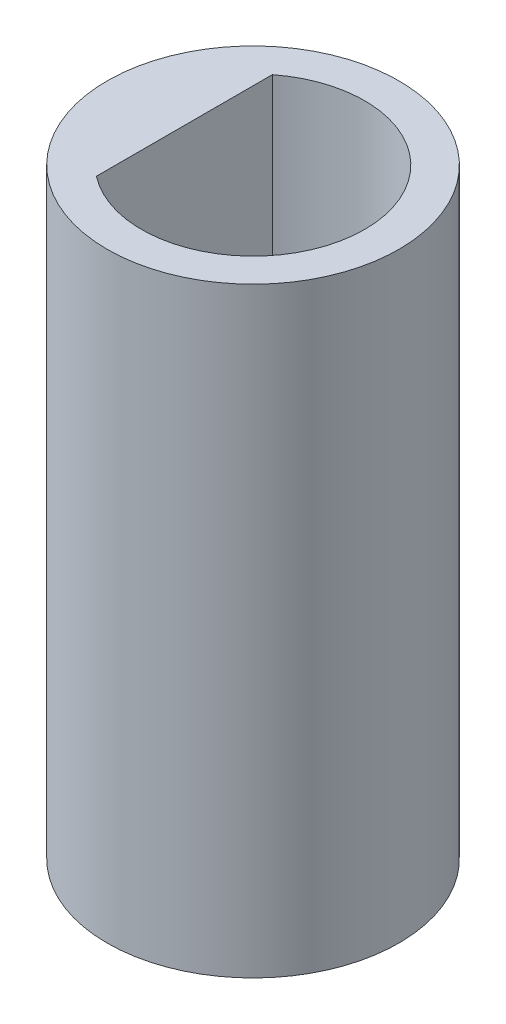
ISO-10303-21;
HEADER;
FILE_DESCRIPTION(('STEP AP214'),'2;1');
FILE_NAME('part.step','',(''),(''),'','','');
FILE_SCHEMA(('AUTOMOTIVE_DESIGN { 1 0 10303 214 1 1 1 1 }'));
ENDSEC;
DATA;
#1=APPLICATION_CONTEXT('core data for automotive mechanical design processes');
#2=APPLICATION_PROTOCOL_DEFINITION('international standard','automotive_design',2000,#1);
#3=PRODUCT_CONTEXT('',#1,'mechanical');
#4=PRODUCT('Part','Part','',(#3));
#5=PRODUCT_RELATED_PRODUCT_CATEGORY('part','',(#4));
#6=PRODUCT_DEFINITION_FORMATION('','',#4);
#7=PRODUCT_DEFINITION_CONTEXT('part definition',#1,'design');
#8=PRODUCT_DEFINITION('design','',#6,#7);
#9=PRODUCT_DEFINITION_SHAPE('','',#8);
#10=(LENGTH_UNIT() NAMED_UNIT(*) SI_UNIT(.MILLI.,.METRE.));
#11=(NAMED_UNIT(*) PLANE_ANGLE_UNIT() SI_UNIT($,.RADIAN.));
#12=(NAMED_UNIT(*) SI_UNIT($,.STERADIAN.) SOLID_ANGLE_UNIT());
#13=UNCERTAINTY_MEASURE_WITH_UNIT(LENGTH_MEASURE(1.E-05),#10,'distance_accuracy_value','');
#14=(GEOMETRIC_REPRESENTATION_CONTEXT(3) GLOBAL_UNCERTAINTY_ASSIGNED_CONTEXT((#13)) GLOBAL_UNIT_ASSIGNED_CONTEXT((#10,
#11,#12)) REPRESENTATION_CONTEXT('',''));
#15=CARTESIAN_POINT('',(0.,0.,0.));
#16=DIRECTION('',(0.,0.,1.));
#17=DIRECTION('',(1.,0.,0.));
#18=AXIS2_PLACEMENT_3D('',#15,#16,#17);
#19=CARTESIAN_POINT('',(0.,14.,0.));
#20=DIRECTION('',(0.,-1.,0.));
#21=DIRECTION('',(0.,0.,-1.));
#22=AXIS2_PLACEMENT_3D('',#19,#20,#21);
#23=CYLINDRICAL_SURFACE('',#22,3.4);
#24=CARTESIAN_POINT('',(0.,14.,0.));
#25=DIRECTION('',(0.,1.,0.));
#26=DIRECTION('',(0.,0.,1.));
#27=AXIS2_PLACEMENT_3D('',#24,#25,#26);
#28=CIRCLE('',#27,3.4);
#29=CARTESIAN_POINT('',(0.,14.,3.4));
#30=VERTEX_POINT('',#29);
#31=EDGE_CURVE('E11',#30,#30,#28,.T.);
#32=ORIENTED_EDGE('',*,*,#31,.F.);
#33=EDGE_LOOP('',(#32));
#34=FACE_BOUND('',#33,.T.);
#35=CARTESIAN_POINT('',(0.,0.,0.));
#36=DIRECTION('',(0.,1.,0.));
#37=DIRECTION('',(0.,0.,1.));
#38=AXIS2_PLACEMENT_3D('',#35,#36,#37);
#39=CIRCLE('',#38,3.4);
#40=CARTESIAN_POINT('',(0.,0.,3.4));
#41=VERTEX_POINT('',#40);
#42=EDGE_CURVE('E36',#41,#41,#39,.T.);
#43=ORIENTED_EDGE('',*,*,#42,.T.);
#44=EDGE_LOOP('',(#43));
#45=FACE_BOUND('',#44,.T.);
#46=ADVANCED_FACE('F33',(#34,#45),#23,.T.);
#47=CARTESIAN_POINT('',(0.,14.,0.));
#48=DIRECTION('',(0.,1.,0.));
#49=DIRECTION('',(0.,0.,1.));
#50=AXIS2_PLACEMENT_3D('',#47,#48,#49);
#51=PLANE('',#50);
#52=CARTESIAN_POINT('',(0.,14.,0.));
#53=DIRECTION('',(0.,1.,0.));
#54=DIRECTION('',(0.,0.,1.));
#55=AXIS2_PLACEMENT_3D('',#52,#53,#54);
#56=CIRCLE('',#55,2.6);
#57=CARTESIAN_POINT('',(-1.6,14.,2.04939015319192));
#58=VERTEX_POINT('',#57);
#59=CARTESIAN_POINT('',(-1.6,14.,-2.04939015319192));
#60=VERTEX_POINT('',#59);
#61=EDGE_CURVE('E47',#58,#60,#56,.T.);
#62=ORIENTED_EDGE('',*,*,#61,.F.);
#63=DIRECTION('',(0.,0.,1.));
#64=VECTOR('',#63,1.);
#65=CARTESIAN_POINT('',(-1.6,14.,-2.04939015319192));
#66=LINE('',#65,#64);
#67=EDGE_CURVE('E66',#60,#58,#66,.T.);
#68=ORIENTED_EDGE('',*,*,#67,.F.);
#69=EDGE_LOOP('',(#62,#68));
#70=FACE_BOUND('',#69,.T.);
#71=ORIENTED_EDGE('',*,*,#31,.T.);
#72=EDGE_LOOP('',(#71));
#73=FACE_BOUND('',#72,.T.);
#74=ADVANCED_FACE('F70',(#70,#73),#51,.T.);
#75=CARTESIAN_POINT('',(0.,0.,0.));
#76=DIRECTION('',(0.,1.,0.));
#77=DIRECTION('',(0.,0.,1.));
#78=AXIS2_PLACEMENT_3D('',#75,#76,#77);
#79=PLANE('',#78);
#80=DIRECTION('',(0.,0.,1.));
#81=VECTOR('',#80,1.);
#82=CARTESIAN_POINT('',(-1.6,0.,-2.04939015319192));
#83=LINE('',#82,#81);
#84=CARTESIAN_POINT('',(-1.6,0.,-2.04939015319192));
#85=VERTEX_POINT('',#84);
#86=CARTESIAN_POINT('',(-1.6,0.,2.04939015319192));
#87=VERTEX_POINT('',#86);
#88=EDGE_CURVE('E74',#85,#87,#83,.T.);
#89=ORIENTED_EDGE('',*,*,#88,.T.);
#90=CARTESIAN_POINT('',(0.,0.,0.));
#91=DIRECTION('',(0.,1.,0.));
#92=DIRECTION('',(0.,0.,1.));
#93=AXIS2_PLACEMENT_3D('',#90,#91,#92);
#94=CIRCLE('',#93,2.6);
#95=EDGE_CURVE('E52',#87,#85,#94,.T.);
#96=ORIENTED_EDGE('',*,*,#95,.T.);
#97=EDGE_LOOP('',(#89,#96));
#98=FACE_BOUND('',#97,.T.);
#99=ORIENTED_EDGE('',*,*,#42,.F.);
#100=EDGE_LOOP('',(#99));
#101=FACE_BOUND('',#100,.T.);
#102=ADVANCED_FACE('F78',(#98,#101),#79,.F.);
#103=CARTESIAN_POINT('',(0.,0.,0.));
#104=DIRECTION('',(0.,1.,0.));
#105=DIRECTION('',(0.,0.,1.));
#106=AXIS2_PLACEMENT_3D('',#103,#104,#105);
#107=CYLINDRICAL_SURFACE('',#106,2.6);
#108=ORIENTED_EDGE('',*,*,#61,.T.);
#109=DIRECTION('',(0.,1.,0.));
#110=VECTOR('',#109,1.);
#111=CARTESIAN_POINT('',(-1.6,0.,-2.04939015319192));
#112=LINE('',#111,#110);
#113=EDGE_CURVE('E63',#85,#60,#112,.T.);
#114=ORIENTED_EDGE('',*,*,#113,.F.);
#115=ORIENTED_EDGE('',*,*,#95,.F.);
#116=DIRECTION('',(0.,1.,0.));
#117=VECTOR('',#116,1.);
#118=CARTESIAN_POINT('',(-1.6,0.,2.04939015319192));
#119=LINE('',#118,#117);
#120=EDGE_CURVE('E57',#87,#58,#119,.T.);
#121=ORIENTED_EDGE('',*,*,#120,.T.);
#122=EDGE_LOOP('',(#108,#114,#115,#121));
#123=FACE_BOUND('',#122,.T.);
#124=ADVANCED_FACE('F59',(#123),#107,.F.);
#125=CARTESIAN_POINT('',(-1.6,0.,-2.04939015319192));
#126=DIRECTION('',(-1.,0.,0.));
#127=DIRECTION('',(0.,0.,1.));
#128=AXIS2_PLACEMENT_3D('',#125,#126,#127);
#129=PLANE('',#128);
#130=ORIENTED_EDGE('',*,*,#67,.T.);
#131=ORIENTED_EDGE('',*,*,#120,.F.);
#132=ORIENTED_EDGE('',*,*,#88,.F.);
#133=ORIENTED_EDGE('',*,*,#113,.T.);
#134=EDGE_LOOP('',(#130,#131,#132,#133));
#135=FACE_BOUND('',#134,.T.);
#136=ADVANCED_FACE('F67',(#135),#129,.F.);
#137=CLOSED_SHELL('',(#46,#74,#102,#124,#136));
#138=MANIFOLD_SOLID_BREP('B2',#137);
#139=ADVANCED_BREP_SHAPE_REPRESENTATION('',(#18,#138),#14);
#140=SHAPE_DEFINITION_REPRESENTATION(#9,#139);
ENDSEC;
END-ISO-10303-21;
